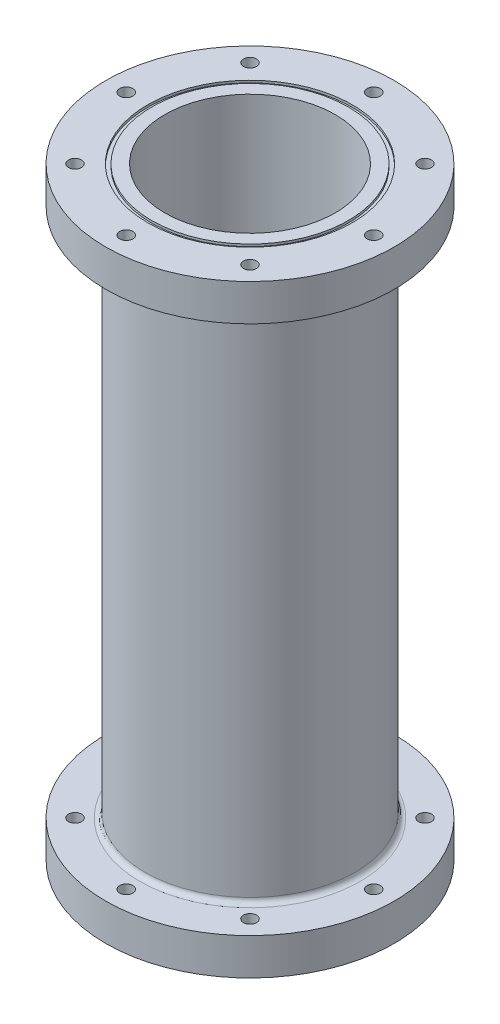
ISO-10303-21;
HEADER;
FILE_DESCRIPTION(('STEP AP214'),'2;1');
FILE_NAME('part.step','',(''),(''),'','','');
FILE_SCHEMA(('AUTOMOTIVE_DESIGN { 1 0 10303 214 1 1 1 1 }'));
ENDSEC;
DATA;
#1=APPLICATION_CONTEXT('core data for automotive mechanical design processes');
#2=APPLICATION_PROTOCOL_DEFINITION('international standard','automotive_design',2000,#1);
#3=PRODUCT_CONTEXT('',#1,'mechanical');
#4=PRODUCT('Part','Part','',(#3));
#5=PRODUCT_RELATED_PRODUCT_CATEGORY('part','',(#4));
#6=PRODUCT_DEFINITION_FORMATION('','',#4);
#7=PRODUCT_DEFINITION_CONTEXT('part definition',#1,'design');
#8=PRODUCT_DEFINITION('design','',#6,#7);
#9=PRODUCT_DEFINITION_SHAPE('','',#8);
#10=(LENGTH_UNIT() NAMED_UNIT(*) SI_UNIT(.MILLI.,.METRE.));
#11=(NAMED_UNIT(*) PLANE_ANGLE_UNIT() SI_UNIT($,.RADIAN.));
#12=(NAMED_UNIT(*) SI_UNIT($,.STERADIAN.) SOLID_ANGLE_UNIT());
#13=UNCERTAINTY_MEASURE_WITH_UNIT(LENGTH_MEASURE(1.E-05),#10,'distance_accuracy_value','');
#14=(GEOMETRIC_REPRESENTATION_CONTEXT(3) GLOBAL_UNCERTAINTY_ASSIGNED_CONTEXT((#13)) GLOBAL_UNIT_ASSIGNED_CONTEXT((#10,
#11,#12)) REPRESENTATION_CONTEXT('',''));
#15=CARTESIAN_POINT('',(0.,0.,0.));
#16=DIRECTION('',(0.,0.,1.));
#17=DIRECTION('',(1.,0.,0.));
#18=AXIS2_PLACEMENT_3D('',#15,#16,#17);
#19=CARTESIAN_POINT('',(0.,292.1,0.));
#20=DIRECTION('',(0.,1.,0.));
#21=DIRECTION('',(0.,0.,1.));
#22=AXIS2_PLACEMENT_3D('',#19,#20,#21);
#23=PLANE('',#22);
#24=CARTESIAN_POINT('',(0.,292.1,0.));
#25=DIRECTION('',(0.,1.,0.));
#26=DIRECTION('',(0.,0.,1.));
#27=AXIS2_PLACEMENT_3D('',#24,#25,#26);
#28=CIRCLE('',#27,41.275);
#29=CARTESIAN_POINT('',(0.,292.1,41.275));
#30=VERTEX_POINT('',#29);
#31=EDGE_CURVE('E52',#30,#30,#28,.T.);
#32=ORIENTED_EDGE('',*,*,#31,.F.);
#33=EDGE_LOOP('',(#32));
#34=FACE_BOUND('',#33,.T.);
#35=CARTESIAN_POINT('',(0.,292.1,0.));
#36=DIRECTION('',(0.,1.,0.));
#37=DIRECTION('',(0.,0.,1.));
#38=AXIS2_PLACEMENT_3D('',#35,#36,#37);
#39=CIRCLE('',#38,47.625);
#40=CARTESIAN_POINT('',(0.,292.1,47.625));
#41=VERTEX_POINT('',#40);
#42=EDGE_CURVE('E129',#41,#41,#39,.T.);
#43=ORIENTED_EDGE('',*,*,#42,.T.);
#44=EDGE_LOOP('',(#43));
#45=FACE_BOUND('',#44,.T.);
#46=ADVANCED_FACE('F32',(#34,#45),#23,.T.);
#47=CARTESIAN_POINT('',(0.,0.,0.));
#48=DIRECTION('',(0.,1.,0.));
#49=DIRECTION('',(0.,0.,1.));
#50=AXIS2_PLACEMENT_3D('',#47,#48,#49);
#51=PLANE('',#50);
#52=CARTESIAN_POINT('',(0.,0.,0.));
#53=DIRECTION('',(0.,1.,0.));
#54=DIRECTION('',(0.,0.,1.));
#55=AXIS2_PLACEMENT_3D('',#52,#53,#54);
#56=CIRCLE('',#55,41.275);
#57=CARTESIAN_POINT('',(0.,0.,41.275));
#58=VERTEX_POINT('',#57);
#59=EDGE_CURVE('E93',#58,#58,#56,.T.);
#60=ORIENTED_EDGE('',*,*,#59,.T.);
#61=EDGE_LOOP('',(#60));
#62=FACE_BOUND('',#61,.T.);
#63=CARTESIAN_POINT('',(0.,0.,0.));
#64=DIRECTION('',(0.,-1.,0.));
#65=DIRECTION('',(0.,0.,-1.));
#66=AXIS2_PLACEMENT_3D('',#63,#64,#65);
#67=CIRCLE('',#66,47.625);
#68=CARTESIAN_POINT('',(0.,0.,-47.625));
#69=VERTEX_POINT('',#68);
#70=EDGE_CURVE('E117',#69,#69,#67,.T.);
#71=ORIENTED_EDGE('',*,*,#70,.T.);
#72=EDGE_LOOP('',(#71));
#73=FACE_BOUND('',#72,.T.);
#74=ADVANCED_FACE('F242',(#62,#73),#51,.F.);
#75=CARTESIAN_POINT('',(0.,292.1,0.));
#76=DIRECTION('',(0.,-1.,0.));
#77=DIRECTION('',(0.,0.,-1.));
#78=AXIS2_PLACEMENT_3D('',#75,#76,#77);
#79=CYLINDRICAL_SURFACE('',#78,50.8);
#80=CARTESIAN_POINT('',(0.,20.32,0.));
#81=DIRECTION('',(0.,-1.,0.));
#82=DIRECTION('',(0.,0.,-1.));
#83=AXIS2_PLACEMENT_3D('',#80,#81,#82);
#84=CIRCLE('',#83,50.8);
#85=CARTESIAN_POINT('',(0.,20.32,-50.8));
#86=VERTEX_POINT('',#85);
#87=EDGE_CURVE('E39',#86,#86,#84,.F.);
#88=ORIENTED_EDGE('',*,*,#87,.T.);
#89=EDGE_LOOP('',(#88));
#90=FACE_BOUND('',#89,.T.);
#91=CARTESIAN_POINT('',(0.,271.78,0.));
#92=DIRECTION('',(0.,1.,0.));
#93=DIRECTION('',(0.,0.,1.));
#94=AXIS2_PLACEMENT_3D('',#91,#92,#93);
#95=CIRCLE('',#94,50.8);
#96=CARTESIAN_POINT('',(0.,271.78,50.8));
#97=VERTEX_POINT('',#96);
#98=EDGE_CURVE('E43',#97,#97,#95,.F.);
#99=ORIENTED_EDGE('',*,*,#98,.T.);
#100=EDGE_LOOP('',(#99));
#101=FACE_BOUND('',#100,.T.);
#102=ADVANCED_FACE('F233',(#90,#101),#79,.T.);
#103=CARTESIAN_POINT('',(-59.9186,292.1,0.));
#104=DIRECTION('',(0.,-1.,0.));
#105=DIRECTION('',(0.,0.,-1.));
#106=AXIS2_PLACEMENT_3D('',#103,#104,#105);
#107=CIRCLE('',#106,3.175);
#108=CARTESIAN_POINT('',(-59.9186,292.1,-3.175));
#109=VERTEX_POINT('',#108);
#110=EDGE_CURVE('E92',#109,#109,#107,.T.);
#111=ORIENTED_EDGE('',*,*,#110,.T.);
#112=EDGE_LOOP('',(#111));
#113=FACE_BOUND('',#112,.T.);
#114=CARTESIAN_POINT('',(-42.3688483792043,292.1,42.3688483792043));
#115=DIRECTION('',(0.,-1.,0.));
#116=DIRECTION('',(0.,0.,-1.));
#117=AXIS2_PLACEMENT_3D('',#114,#115,#116);
#118=CIRCLE('',#117,3.175);
#119=CARTESIAN_POINT('',(-42.3688483792043,292.1,39.1938483792043));
#120=VERTEX_POINT('',#119);
#121=EDGE_CURVE('E185',#120,#120,#118,.T.);
#122=ORIENTED_EDGE('',*,*,#121,.T.);
#123=EDGE_LOOP('',(#122));
#124=FACE_BOUND('',#123,.T.);
#125=CARTESIAN_POINT('',(0.,292.1,59.9186));
#126=DIRECTION('',(0.,-1.,0.));
#127=DIRECTION('',(0.,0.,-1.));
#128=AXIS2_PLACEMENT_3D('',#125,#126,#127);
#129=CIRCLE('',#128,3.175);
#130=CARTESIAN_POINT('',(0.,292.1,56.7436));
#131=VERTEX_POINT('',#130);
#132=EDGE_CURVE('E182',#131,#131,#129,.T.);
#133=ORIENTED_EDGE('',*,*,#132,.T.);
#134=EDGE_LOOP('',(#133));
#135=FACE_BOUND('',#134,.T.);
#136=CARTESIAN_POINT('',(42.3688483792043,292.1,42.3688483792043));
#137=DIRECTION('',(0.,-1.,0.));
#138=DIRECTION('',(0.,0.,-1.));
#139=AXIS2_PLACEMENT_3D('',#136,#137,#138);
#140=CIRCLE('',#139,3.175);
#141=CARTESIAN_POINT('',(42.3688483792043,292.1,39.1938483792043));
#142=VERTEX_POINT('',#141);
#143=EDGE_CURVE('E179',#142,#142,#140,.T.);
#144=ORIENTED_EDGE('',*,*,#143,.T.);
#145=EDGE_LOOP('',(#144));
#146=FACE_BOUND('',#145,.T.);
#147=CARTESIAN_POINT('',(59.9186,292.1,0.));
#148=DIRECTION('',(0.,-1.,0.));
#149=DIRECTION('',(0.,0.,-1.));
#150=AXIS2_PLACEMENT_3D('',#147,#148,#149);
#151=CIRCLE('',#150,3.17500000000001);
#152=CARTESIAN_POINT('',(59.9186,292.1,-3.175));
#153=VERTEX_POINT('',#152);
#154=EDGE_CURVE('E176',#153,#153,#151,.T.);
#155=ORIENTED_EDGE('',*,*,#154,.T.);
#156=EDGE_LOOP('',(#155));
#157=FACE_BOUND('',#156,.T.);
#158=CARTESIAN_POINT('',(42.3688483792043,292.1,-42.3688483792043));
#159=DIRECTION('',(0.,-1.,0.));
#160=DIRECTION('',(0.,0.,-1.));
#161=AXIS2_PLACEMENT_3D('',#158,#159,#160);
#162=CIRCLE('',#161,3.17500000000001);
#163=CARTESIAN_POINT('',(42.3688483792043,292.1,-45.5438483792043));
#164=VERTEX_POINT('',#163);
#165=EDGE_CURVE('E173',#164,#164,#162,.T.);
#166=ORIENTED_EDGE('',*,*,#165,.T.);
#167=EDGE_LOOP('',(#166));
#168=FACE_BOUND('',#167,.T.);
#169=CARTESIAN_POINT('',(0.,292.1,-59.9186));
#170=DIRECTION('',(0.,-1.,0.));
#171=DIRECTION('',(0.,0.,-1.));
#172=AXIS2_PLACEMENT_3D('',#169,#170,#171);
#173=CIRCLE('',#172,3.175);
#174=CARTESIAN_POINT('',(0.,292.1,-63.0936));
#175=VERTEX_POINT('',#174);
#176=EDGE_CURVE('E170',#175,#175,#173,.T.);
#177=ORIENTED_EDGE('',*,*,#176,.T.);
#178=EDGE_LOOP('',(#177));
#179=FACE_BOUND('',#178,.T.);
#180=CARTESIAN_POINT('',(-42.3688483792043,292.1,-42.3688483792043));
#181=DIRECTION('',(0.,-1.,0.));
#182=DIRECTION('',(0.,0.,-1.));
#183=AXIS2_PLACEMENT_3D('',#180,#181,#182);
#184=CIRCLE('',#183,3.17500000000001);
#185=CARTESIAN_POINT('',(-42.3688483792043,292.1,-45.5438483792043));
#186=VERTEX_POINT('',#185);
#187=EDGE_CURVE('E167',#186,#186,#184,.T.);
#188=ORIENTED_EDGE('',*,*,#187,.T.);
#189=EDGE_LOOP('',(#188));
#190=FACE_BOUND('',#189,.T.);
#191=CARTESIAN_POINT('',(0.,292.1,0.));
#192=DIRECTION('',(0.,1.,0.));
#193=DIRECTION('',(0.,0.,1.));
#194=AXIS2_PLACEMENT_3D('',#191,#192,#193);
#195=CIRCLE('',#194,49.53);
#196=CARTESIAN_POINT('',(0.,292.1,49.53));
#197=VERTEX_POINT('',#196);
#198=EDGE_CURVE('E123',#197,#197,#195,.T.);
#199=ORIENTED_EDGE('',*,*,#198,.F.);
#200=EDGE_LOOP('',(#199));
#201=FACE_BOUND('',#200,.T.);
#202=CARTESIAN_POINT('',(0.,292.1,0.));
#203=DIRECTION('',(0.,1.,0.));
#204=DIRECTION('',(0.,0.,1.));
#205=AXIS2_PLACEMENT_3D('',#202,#203,#204);
#206=CIRCLE('',#205,69.85);
#207=CARTESIAN_POINT('',(0.,292.1,69.85));
#208=VERTEX_POINT('',#207);
#209=EDGE_CURVE('E105',#208,#208,#206,.T.);
#210=ORIENTED_EDGE('',*,*,#209,.T.);
#211=EDGE_LOOP('',(#210));
#212=FACE_BOUND('',#211,.T.);
#213=ADVANCED_FACE('F191',(#113,#124,#135,#146,#157,#168,#179,#190,#201,#212),#23,.T.);
#214=CARTESIAN_POINT('',(-59.9186,0.,0.));
#215=DIRECTION('',(0.,1.,0.));
#216=DIRECTION('',(0.,0.,1.));
#217=AXIS2_PLACEMENT_3D('',#214,#215,#216);
#218=CIRCLE('',#217,3.175);
#219=CARTESIAN_POINT('',(-59.9186,0.,3.175));
#220=VERTEX_POINT('',#219);
#221=EDGE_CURVE('E132',#220,#220,#218,.T.);
#222=ORIENTED_EDGE('',*,*,#221,.T.);
#223=EDGE_LOOP('',(#222));
#224=FACE_BOUND('',#223,.T.);
#225=CARTESIAN_POINT('',(-42.3688483792043,0.,42.3688483792043));
#226=DIRECTION('',(0.,1.,0.));
#227=DIRECTION('',(0.,0.,1.));
#228=AXIS2_PLACEMENT_3D('',#225,#226,#227);
#229=CIRCLE('',#228,3.175);
#230=CARTESIAN_POINT('',(-42.3688483792043,0.,45.5438483792043));
#231=VERTEX_POINT('',#230);
#232=EDGE_CURVE('E57',#231,#231,#229,.T.);
#233=ORIENTED_EDGE('',*,*,#232,.T.);
#234=EDGE_LOOP('',(#233));
#235=FACE_BOUND('',#234,.T.);
#236=CARTESIAN_POINT('',(0.,0.,59.9186));
#237=DIRECTION('',(0.,1.,0.));
#238=DIRECTION('',(0.,0.,1.));
#239=AXIS2_PLACEMENT_3D('',#236,#237,#238);
#240=CIRCLE('',#239,3.175);
#241=CARTESIAN_POINT('',(0.,0.,63.0936));
#242=VERTEX_POINT('',#241);
#243=EDGE_CURVE('E62',#242,#242,#240,.T.);
#244=ORIENTED_EDGE('',*,*,#243,.T.);
#245=EDGE_LOOP('',(#244));
#246=FACE_BOUND('',#245,.T.);
#247=CARTESIAN_POINT('',(42.3688483792043,0.,42.3688483792043));
#248=DIRECTION('',(0.,1.,0.));
#249=DIRECTION('',(0.,0.,1.));
#250=AXIS2_PLACEMENT_3D('',#247,#248,#249);
#251=CIRCLE('',#250,3.175);
#252=CARTESIAN_POINT('',(42.3688483792043,0.,45.5438483792043));
#253=VERTEX_POINT('',#252);
#254=EDGE_CURVE('E67',#253,#253,#251,.T.);
#255=ORIENTED_EDGE('',*,*,#254,.T.);
#256=EDGE_LOOP('',(#255));
#257=FACE_BOUND('',#256,.T.);
#258=CARTESIAN_POINT('',(59.9186,0.,0.));
#259=DIRECTION('',(0.,1.,0.));
#260=DIRECTION('',(0.,0.,1.));
#261=AXIS2_PLACEMENT_3D('',#258,#259,#260);
#262=CIRCLE('',#261,3.17500000000001);
#263=CARTESIAN_POINT('',(59.9186,0.,3.17500000000001));
#264=VERTEX_POINT('',#263);
#265=EDGE_CURVE('E72',#264,#264,#262,.T.);
#266=ORIENTED_EDGE('',*,*,#265,.T.);
#267=EDGE_LOOP('',(#266));
#268=FACE_BOUND('',#267,.T.);
#269=CARTESIAN_POINT('',(42.3688483792043,0.,-42.3688483792043));
#270=DIRECTION('',(0.,1.,0.));
#271=DIRECTION('',(0.,0.,1.));
#272=AXIS2_PLACEMENT_3D('',#269,#270,#271);
#273=CIRCLE('',#272,3.17500000000001);
#274=CARTESIAN_POINT('',(42.3688483792043,0.,-39.1938483792043));
#275=VERTEX_POINT('',#274);
#276=EDGE_CURVE('E77',#275,#275,#273,.T.);
#277=ORIENTED_EDGE('',*,*,#276,.T.);
#278=EDGE_LOOP('',(#277));
#279=FACE_BOUND('',#278,.T.);
#280=CARTESIAN_POINT('',(0.,0.,-59.9186));
#281=DIRECTION('',(0.,1.,0.));
#282=DIRECTION('',(0.,0.,1.));
#283=AXIS2_PLACEMENT_3D('',#280,#281,#282);
#284=CIRCLE('',#283,3.175);
#285=CARTESIAN_POINT('',(0.,0.,-56.7436));
#286=VERTEX_POINT('',#285);
#287=EDGE_CURVE('E82',#286,#286,#284,.T.);
#288=ORIENTED_EDGE('',*,*,#287,.T.);
#289=EDGE_LOOP('',(#288));
#290=FACE_BOUND('',#289,.T.);
#291=CARTESIAN_POINT('',(-42.3688483792043,0.,-42.3688483792043));
#292=DIRECTION('',(0.,1.,0.));
#293=DIRECTION('',(0.,0.,1.));
#294=AXIS2_PLACEMENT_3D('',#291,#292,#293);
#295=CIRCLE('',#294,3.17500000000001);
#296=CARTESIAN_POINT('',(-42.3688483792043,0.,-39.1938483792043));
#297=VERTEX_POINT('',#296);
#298=EDGE_CURVE('E87',#297,#297,#295,.T.);
#299=ORIENTED_EDGE('',*,*,#298,.T.);
#300=EDGE_LOOP('',(#299));
#301=FACE_BOUND('',#300,.T.);
#302=CARTESIAN_POINT('',(0.,0.,0.));
#303=DIRECTION('',(0.,-1.,0.));
#304=DIRECTION('',(0.,0.,-1.));
#305=AXIS2_PLACEMENT_3D('',#302,#303,#304);
#306=CIRCLE('',#305,49.53);
#307=CARTESIAN_POINT('',(0.,0.,-49.53));
#308=VERTEX_POINT('',#307);
#309=EDGE_CURVE('E111',#308,#308,#306,.T.);
#310=ORIENTED_EDGE('',*,*,#309,.F.);
#311=EDGE_LOOP('',(#310));
#312=FACE_BOUND('',#311,.T.);
#313=CARTESIAN_POINT('',(0.,0.,0.));
#314=DIRECTION('',(0.,-1.,0.));
#315=DIRECTION('',(0.,0.,-1.));
#316=AXIS2_PLACEMENT_3D('',#313,#314,#315);
#317=CIRCLE('',#316,69.85);
#318=CARTESIAN_POINT('',(0.,0.,-69.85));
#319=VERTEX_POINT('',#318);
#320=EDGE_CURVE('E99',#319,#319,#317,.T.);
#321=ORIENTED_EDGE('',*,*,#320,.T.);
#322=EDGE_LOOP('',(#321));
#323=FACE_BOUND('',#322,.T.);
#324=ADVANCED_FACE('F232',(#224,#235,#246,#257,#268,#279,#290,#301,#312,#323),#51,.F.);
#325=CARTESIAN_POINT('',(0.,292.1,0.));
#326=DIRECTION('',(0.,-1.,0.));
#327=DIRECTION('',(0.,0.,-1.));
#328=AXIS2_PLACEMENT_3D('',#325,#326,#327);
#329=CYLINDRICAL_SURFACE('',#328,41.275);
#330=ORIENTED_EDGE('',*,*,#31,.T.);
#331=EDGE_LOOP('',(#330));
#332=FACE_BOUND('',#331,.T.);
#333=ORIENTED_EDGE('',*,*,#59,.F.);
#334=EDGE_LOOP('',(#333));
#335=FACE_BOUND('',#334,.T.);
#336=ADVANCED_FACE('F239',(#332,#335),#329,.F.);
#337=CARTESIAN_POINT('',(0.,17.78,0.));
#338=DIRECTION('',(0.,-1.,0.));
#339=DIRECTION('',(0.,0.,-1.));
#340=AXIS2_PLACEMENT_3D('',#337,#338,#339);
#341=PLANE('',#340);
#342=CARTESIAN_POINT('',(0.,17.78,0.));
#343=DIRECTION('',(0.,-1.,0.));
#344=DIRECTION('',(0.,0.,-1.));
#345=AXIS2_PLACEMENT_3D('',#342,#343,#344);
#346=CIRCLE('',#345,53.34);
#347=CARTESIAN_POINT('',(0.,17.78,-53.34));
#348=VERTEX_POINT('',#347);
#349=EDGE_CURVE('E47',#348,#348,#346,.T.);
#350=ORIENTED_EDGE('',*,*,#349,.T.);
#351=EDGE_LOOP('',(#350));
#352=FACE_BOUND('',#351,.T.);
#353=CARTESIAN_POINT('',(-59.9186,17.78,0.));
#354=DIRECTION('',(0.,-1.,0.));
#355=DIRECTION('',(0.,0.,-1.));
#356=AXIS2_PLACEMENT_3D('',#353,#354,#355);
#357=CIRCLE('',#356,3.175);
#358=CARTESIAN_POINT('',(-59.9186,17.78,-3.175));
#359=VERTEX_POINT('',#358);
#360=EDGE_CURVE('E56',#359,#359,#357,.T.);
#361=ORIENTED_EDGE('',*,*,#360,.T.);
#362=EDGE_LOOP('',(#361));
#363=FACE_BOUND('',#362,.T.);
#364=CARTESIAN_POINT('',(-42.3688483792043,17.78,42.3688483792043));
#365=DIRECTION('',(0.,-1.,0.));
#366=DIRECTION('',(0.,0.,-1.));
#367=AXIS2_PLACEMENT_3D('',#364,#365,#366);
#368=CIRCLE('',#367,3.175);
#369=CARTESIAN_POINT('',(-42.3688483792043,17.78,39.1938483792043));
#370=VERTEX_POINT('',#369);
#371=EDGE_CURVE('E61',#370,#370,#368,.T.);
#372=ORIENTED_EDGE('',*,*,#371,.T.);
#373=EDGE_LOOP('',(#372));
#374=FACE_BOUND('',#373,.T.);
#375=CARTESIAN_POINT('',(0.,17.78,59.9186));
#376=DIRECTION('',(0.,-1.,0.));
#377=DIRECTION('',(0.,0.,-1.));
#378=AXIS2_PLACEMENT_3D('',#375,#376,#377);
#379=CIRCLE('',#378,3.175);
#380=CARTESIAN_POINT('',(0.,17.78,56.7436));
#381=VERTEX_POINT('',#380);
#382=EDGE_CURVE('E66',#381,#381,#379,.T.);
#383=ORIENTED_EDGE('',*,*,#382,.T.);
#384=EDGE_LOOP('',(#383));
#385=FACE_BOUND('',#384,.T.);
#386=CARTESIAN_POINT('',(42.3688483792043,17.78,42.3688483792043));
#387=DIRECTION('',(0.,-1.,0.));
#388=DIRECTION('',(0.,0.,-1.));
#389=AXIS2_PLACEMENT_3D('',#386,#387,#388);
#390=CIRCLE('',#389,3.175);
#391=CARTESIAN_POINT('',(42.3688483792043,17.78,39.1938483792043));
#392=VERTEX_POINT('',#391);
#393=EDGE_CURVE('E71',#392,#392,#390,.T.);
#394=ORIENTED_EDGE('',*,*,#393,.T.);
#395=EDGE_LOOP('',(#394));
#396=FACE_BOUND('',#395,.T.);
#397=CARTESIAN_POINT('',(59.9186,17.78,0.));
#398=DIRECTION('',(0.,-1.,0.));
#399=DIRECTION('',(0.,0.,-1.));
#400=AXIS2_PLACEMENT_3D('',#397,#398,#399);
#401=CIRCLE('',#400,3.17500000000001);
#402=CARTESIAN_POINT('',(59.9186,17.78,-3.175));
#403=VERTEX_POINT('',#402);
#404=EDGE_CURVE('E76',#403,#403,#401,.T.);
#405=ORIENTED_EDGE('',*,*,#404,.T.);
#406=EDGE_LOOP('',(#405));
#407=FACE_BOUND('',#406,.T.);
#408=CARTESIAN_POINT('',(42.3688483792043,17.78,-42.3688483792043));
#409=DIRECTION('',(0.,-1.,0.));
#410=DIRECTION('',(0.,0.,-1.));
#411=AXIS2_PLACEMENT_3D('',#408,#409,#410);
#412=CIRCLE('',#411,3.17500000000001);
#413=CARTESIAN_POINT('',(42.3688483792043,17.78,-45.5438483792043));
#414=VERTEX_POINT('',#413);
#415=EDGE_CURVE('E81',#414,#414,#412,.T.);
#416=ORIENTED_EDGE('',*,*,#415,.T.);
#417=EDGE_LOOP('',(#416));
#418=FACE_BOUND('',#417,.T.);
#419=CARTESIAN_POINT('',(0.,17.78,-59.9186));
#420=DIRECTION('',(0.,-1.,0.));
#421=DIRECTION('',(0.,0.,-1.));
#422=AXIS2_PLACEMENT_3D('',#419,#420,#421);
#423=CIRCLE('',#422,3.175);
#424=CARTESIAN_POINT('',(0.,17.78,-63.0936));
#425=VERTEX_POINT('',#424);
#426=EDGE_CURVE('E86',#425,#425,#423,.T.);
#427=ORIENTED_EDGE('',*,*,#426,.T.);
#428=EDGE_LOOP('',(#427));
#429=FACE_BOUND('',#428,.T.);
#430=CARTESIAN_POINT('',(-42.3688483792043,17.78,-42.3688483792043));
#431=DIRECTION('',(0.,-1.,0.));
#432=DIRECTION('',(0.,0.,-1.));
#433=AXIS2_PLACEMENT_3D('',#430,#431,#432);
#434=CIRCLE('',#433,3.17500000000001);
#435=CARTESIAN_POINT('',(-42.3688483792043,17.78,-45.5438483792043));
#436=VERTEX_POINT('',#435);
#437=EDGE_CURVE('E91',#436,#436,#434,.T.);
#438=ORIENTED_EDGE('',*,*,#437,.T.);
#439=EDGE_LOOP('',(#438));
#440=FACE_BOUND('',#439,.T.);
#441=CARTESIAN_POINT('',(0.,17.78,0.));
#442=DIRECTION('',(0.,-1.,0.));
#443=DIRECTION('',(0.,0.,-1.));
#444=AXIS2_PLACEMENT_3D('',#441,#442,#443);
#445=CIRCLE('',#444,69.85);
#446=CARTESIAN_POINT('',(0.,17.78,-69.85));
#447=VERTEX_POINT('',#446);
#448=EDGE_CURVE('E96',#447,#447,#445,.T.);
#449=ORIENTED_EDGE('',*,*,#448,.F.);
#450=EDGE_LOOP('',(#449));
#451=FACE_BOUND('',#450,.T.);
#452=ADVANCED_FACE('F287',(#352,#363,#374,#385,#396,#407,#418,#429,#440,#451),#341,.F.);
#453=CARTESIAN_POINT('',(0.,17.78,0.));
#454=DIRECTION('',(0.,-1.,0.));
#455=DIRECTION('',(0.,0.,-1.));
#456=AXIS2_PLACEMENT_3D('',#453,#454,#455);
#457=CYLINDRICAL_SURFACE('',#456,69.85);
#458=ORIENTED_EDGE('',*,*,#448,.T.);
#459=EDGE_LOOP('',(#458));
#460=FACE_BOUND('',#459,.T.);
#461=ORIENTED_EDGE('',*,*,#320,.F.);
#462=EDGE_LOOP('',(#461));
#463=FACE_BOUND('',#462,.T.);
#464=ADVANCED_FACE('F207',(#460,#463),#457,.T.);
#465=CARTESIAN_POINT('',(0.,274.32,0.));
#466=DIRECTION('',(0.,1.,0.));
#467=DIRECTION('',(0.,0.,1.));
#468=AXIS2_PLACEMENT_3D('',#465,#466,#467);
#469=PLANE('',#468);
#470=CARTESIAN_POINT('',(0.,274.32,0.));
#471=DIRECTION('',(0.,1.,0.));
#472=DIRECTION('',(0.,0.,1.));
#473=AXIS2_PLACEMENT_3D('',#470,#471,#472);
#474=CIRCLE('',#473,53.34);
#475=CARTESIAN_POINT('',(0.,274.32,53.34));
#476=VERTEX_POINT('',#475);
#477=EDGE_CURVE('E10',#476,#476,#474,.T.);
#478=ORIENTED_EDGE('',*,*,#477,.T.);
#479=EDGE_LOOP('',(#478));
#480=FACE_BOUND('',#479,.T.);
#481=CARTESIAN_POINT('',(-59.9186,274.32,0.));
#482=DIRECTION('',(0.,1.,0.));
#483=DIRECTION('',(0.,0.,1.));
#484=AXIS2_PLACEMENT_3D('',#481,#482,#483);
#485=CIRCLE('',#484,3.175);
#486=CARTESIAN_POINT('',(-59.9186,274.32,3.175));
#487=VERTEX_POINT('',#486);
#488=EDGE_CURVE('E53',#487,#487,#485,.T.);
#489=ORIENTED_EDGE('',*,*,#488,.T.);
#490=EDGE_LOOP('',(#489));
#491=FACE_BOUND('',#490,.T.);
#492=CARTESIAN_POINT('',(-42.3688483792043,274.32,42.3688483792043));
#493=DIRECTION('',(0.,1.,0.));
#494=DIRECTION('',(0.,0.,1.));
#495=AXIS2_PLACEMENT_3D('',#492,#493,#494);
#496=CIRCLE('',#495,3.175);
#497=CARTESIAN_POINT('',(-42.3688483792043,274.32,45.5438483792043));
#498=VERTEX_POINT('',#497);
#499=EDGE_CURVE('E58',#498,#498,#496,.T.);
#500=ORIENTED_EDGE('',*,*,#499,.T.);
#501=EDGE_LOOP('',(#500));
#502=FACE_BOUND('',#501,.T.);
#503=CARTESIAN_POINT('',(0.,274.32,59.9186));
#504=DIRECTION('',(0.,1.,0.));
#505=DIRECTION('',(0.,0.,1.));
#506=AXIS2_PLACEMENT_3D('',#503,#504,#505);
#507=CIRCLE('',#506,3.175);
#508=CARTESIAN_POINT('',(0.,274.32,63.0936));
#509=VERTEX_POINT('',#508);
#510=EDGE_CURVE('E63',#509,#509,#507,.T.);
#511=ORIENTED_EDGE('',*,*,#510,.T.);
#512=EDGE_LOOP('',(#511));
#513=FACE_BOUND('',#512,.T.);
#514=CARTESIAN_POINT('',(42.3688483792043,274.32,42.3688483792043));
#515=DIRECTION('',(0.,1.,0.));
#516=DIRECTION('',(0.,0.,1.));
#517=AXIS2_PLACEMENT_3D('',#514,#515,#516);
#518=CIRCLE('',#517,3.175);
#519=CARTESIAN_POINT('',(42.3688483792043,274.32,45.5438483792043));
#520=VERTEX_POINT('',#519);
#521=EDGE_CURVE('E68',#520,#520,#518,.T.);
#522=ORIENTED_EDGE('',*,*,#521,.T.);
#523=EDGE_LOOP('',(#522));
#524=FACE_BOUND('',#523,.T.);
#525=CARTESIAN_POINT('',(59.9186,274.32,0.));
#526=DIRECTION('',(0.,1.,0.));
#527=DIRECTION('',(0.,0.,1.));
#528=AXIS2_PLACEMENT_3D('',#525,#526,#527);
#529=CIRCLE('',#528,3.17500000000001);
#530=CARTESIAN_POINT('',(59.9186,274.32,3.17500000000001));
#531=VERTEX_POINT('',#530);
#532=EDGE_CURVE('E73',#531,#531,#529,.T.);
#533=ORIENTED_EDGE('',*,*,#532,.T.);
#534=EDGE_LOOP('',(#533));
#535=FACE_BOUND('',#534,.T.);
#536=CARTESIAN_POINT('',(42.3688483792043,274.32,-42.3688483792043));
#537=DIRECTION('',(0.,1.,0.));
#538=DIRECTION('',(0.,0.,1.));
#539=AXIS2_PLACEMENT_3D('',#536,#537,#538);
#540=CIRCLE('',#539,3.17500000000001);
#541=CARTESIAN_POINT('',(42.3688483792043,274.32,-39.1938483792043));
#542=VERTEX_POINT('',#541);
#543=EDGE_CURVE('E78',#542,#542,#540,.T.);
#544=ORIENTED_EDGE('',*,*,#543,.T.);
#545=EDGE_LOOP('',(#544));
#546=FACE_BOUND('',#545,.T.);
#547=CARTESIAN_POINT('',(0.,274.32,-59.9186));
#548=DIRECTION('',(0.,1.,0.));
#549=DIRECTION('',(0.,0.,1.));
#550=AXIS2_PLACEMENT_3D('',#547,#548,#549);
#551=CIRCLE('',#550,3.175);
#552=CARTESIAN_POINT('',(0.,274.32,-56.7436));
#553=VERTEX_POINT('',#552);
#554=EDGE_CURVE('E83',#553,#553,#551,.T.);
#555=ORIENTED_EDGE('',*,*,#554,.T.);
#556=EDGE_LOOP('',(#555));
#557=FACE_BOUND('',#556,.T.);
#558=CARTESIAN_POINT('',(-42.3688483792043,274.32,-42.3688483792043));
#559=DIRECTION('',(0.,1.,0.));
#560=DIRECTION('',(0.,0.,1.));
#561=AXIS2_PLACEMENT_3D('',#558,#559,#560);
#562=CIRCLE('',#561,3.17500000000001);
#563=CARTESIAN_POINT('',(-42.3688483792043,274.32,-39.1938483792043));
#564=VERTEX_POINT('',#563);
#565=EDGE_CURVE('E88',#564,#564,#562,.T.);
#566=ORIENTED_EDGE('',*,*,#565,.T.);
#567=EDGE_LOOP('',(#566));
#568=FACE_BOUND('',#567,.T.);
#569=CARTESIAN_POINT('',(0.,274.32,0.));
#570=DIRECTION('',(0.,1.,0.));
#571=DIRECTION('',(0.,0.,1.));
#572=AXIS2_PLACEMENT_3D('',#569,#570,#571);
#573=CIRCLE('',#572,69.85);
#574=CARTESIAN_POINT('',(0.,274.32,69.85));
#575=VERTEX_POINT('',#574);
#576=EDGE_CURVE('E102',#575,#575,#573,.T.);
#577=ORIENTED_EDGE('',*,*,#576,.F.);
#578=EDGE_LOOP('',(#577));
#579=FACE_BOUND('',#578,.T.);
#580=ADVANCED_FACE('F203',(#480,#491,#502,#513,#524,#535,#546,#557,#568,#579),#469,.F.);
#581=CARTESIAN_POINT('',(0.,274.32,0.));
#582=DIRECTION('',(0.,1.,0.));
#583=DIRECTION('',(0.,0.,1.));
#584=AXIS2_PLACEMENT_3D('',#581,#582,#583);
#585=CYLINDRICAL_SURFACE('',#584,69.85);
#586=ORIENTED_EDGE('',*,*,#576,.T.);
#587=EDGE_LOOP('',(#586));
#588=FACE_BOUND('',#587,.T.);
#589=ORIENTED_EDGE('',*,*,#209,.F.);
#590=EDGE_LOOP('',(#589));
#591=FACE_BOUND('',#590,.T.);
#592=ADVANCED_FACE('F206',(#588,#591),#585,.T.);
#593=CARTESIAN_POINT('',(0.,1.1176,0.));
#594=DIRECTION('',(0.,-1.,0.));
#595=DIRECTION('',(0.,0.,-1.));
#596=AXIS2_PLACEMENT_3D('',#593,#594,#595);
#597=CYLINDRICAL_SURFACE('',#596,49.53);
#598=CARTESIAN_POINT('',(0.,1.1176,0.));
#599=DIRECTION('',(0.,-1.,0.));
#600=DIRECTION('',(0.,0.,-1.));
#601=AXIS2_PLACEMENT_3D('',#598,#599,#600);
#602=CIRCLE('',#601,49.53);
#603=CARTESIAN_POINT('',(0.,1.1176,-49.53));
#604=VERTEX_POINT('',#603);
#605=EDGE_CURVE('E108',#604,#604,#602,.T.);
#606=ORIENTED_EDGE('',*,*,#605,.F.);
#607=EDGE_LOOP('',(#606));
#608=FACE_BOUND('',#607,.T.);
#609=ORIENTED_EDGE('',*,*,#309,.T.);
#610=EDGE_LOOP('',(#609));
#611=FACE_BOUND('',#610,.T.);
#612=ADVANCED_FACE('F227',(#608,#611),#597,.F.);
#613=CARTESIAN_POINT('',(0.,1.1176,0.));
#614=DIRECTION('',(0.,-1.,0.));
#615=DIRECTION('',(0.,0.,-1.));
#616=AXIS2_PLACEMENT_3D('',#613,#614,#615);
#617=PLANE('',#616);
#618=CARTESIAN_POINT('',(0.,1.1176,0.));
#619=DIRECTION('',(0.,-1.,0.));
#620=DIRECTION('',(0.,0.,-1.));
#621=AXIS2_PLACEMENT_3D('',#618,#619,#620);
#622=CIRCLE('',#621,47.625);
#623=CARTESIAN_POINT('',(0.,1.1176,-47.625));
#624=VERTEX_POINT('',#623);
#625=EDGE_CURVE('E114',#624,#624,#622,.T.);
#626=ORIENTED_EDGE('',*,*,#625,.F.);
#627=EDGE_LOOP('',(#626));
#628=FACE_BOUND('',#627,.T.);
#629=ORIENTED_EDGE('',*,*,#605,.T.);
#630=EDGE_LOOP('',(#629));
#631=FACE_BOUND('',#630,.T.);
#632=ADVANCED_FACE('F279',(#628,#631),#617,.T.);
#633=CARTESIAN_POINT('',(0.,1.1176,0.));
#634=DIRECTION('',(0.,-1.,0.));
#635=DIRECTION('',(0.,0.,-1.));
#636=AXIS2_PLACEMENT_3D('',#633,#634,#635);
#637=CYLINDRICAL_SURFACE('',#636,47.625);
#638=ORIENTED_EDGE('',*,*,#625,.T.);
#639=EDGE_LOOP('',(#638));
#640=FACE_BOUND('',#639,.T.);
#641=ORIENTED_EDGE('',*,*,#70,.F.);
#642=EDGE_LOOP('',(#641));
#643=FACE_BOUND('',#642,.T.);
#644=ADVANCED_FACE('F275',(#640,#643),#637,.T.);
#645=CARTESIAN_POINT('',(0.,290.9824,0.));
#646=DIRECTION('',(0.,1.,0.));
#647=DIRECTION('',(0.,0.,1.));
#648=AXIS2_PLACEMENT_3D('',#645,#646,#647);
#649=CYLINDRICAL_SURFACE('',#648,49.53);
#650=CARTESIAN_POINT('',(0.,290.9824,0.));
#651=DIRECTION('',(0.,1.,0.));
#652=DIRECTION('',(0.,0.,1.));
#653=AXIS2_PLACEMENT_3D('',#650,#651,#652);
#654=CIRCLE('',#653,49.53);
#655=CARTESIAN_POINT('',(0.,290.9824,49.53));
#656=VERTEX_POINT('',#655);
#657=EDGE_CURVE('E120',#656,#656,#654,.T.);
#658=ORIENTED_EDGE('',*,*,#657,.F.);
#659=EDGE_LOOP('',(#658));
#660=FACE_BOUND('',#659,.T.);
#661=ORIENTED_EDGE('',*,*,#198,.T.);
#662=EDGE_LOOP('',(#661));
#663=FACE_BOUND('',#662,.T.);
#664=ADVANCED_FACE('F268',(#660,#663),#649,.F.);
#665=CARTESIAN_POINT('',(0.,290.9824,0.));
#666=DIRECTION('',(0.,1.,0.));
#667=DIRECTION('',(0.,0.,1.));
#668=AXIS2_PLACEMENT_3D('',#665,#666,#667);
#669=PLANE('',#668);
#670=CARTESIAN_POINT('',(0.,290.9824,0.));
#671=DIRECTION('',(0.,1.,0.));
#672=DIRECTION('',(0.,0.,1.));
#673=AXIS2_PLACEMENT_3D('',#670,#671,#672);
#674=CIRCLE('',#673,47.625);
#675=CARTESIAN_POINT('',(0.,290.9824,47.625));
#676=VERTEX_POINT('',#675);
#677=EDGE_CURVE('E126',#676,#676,#674,.T.);
#678=ORIENTED_EDGE('',*,*,#677,.F.);
#679=EDGE_LOOP('',(#678));
#680=FACE_BOUND('',#679,.T.);
#681=ORIENTED_EDGE('',*,*,#657,.T.);
#682=EDGE_LOOP('',(#681));
#683=FACE_BOUND('',#682,.T.);
#684=ADVANCED_FACE('F258',(#680,#683),#669,.T.);
#685=CARTESIAN_POINT('',(0.,290.9824,0.));
#686=DIRECTION('',(0.,1.,0.));
#687=DIRECTION('',(0.,0.,1.));
#688=AXIS2_PLACEMENT_3D('',#685,#686,#687);
#689=CYLINDRICAL_SURFACE('',#688,47.625);
#690=ORIENTED_EDGE('',*,*,#677,.T.);
#691=EDGE_LOOP('',(#690));
#692=FACE_BOUND('',#691,.T.);
#693=ORIENTED_EDGE('',*,*,#42,.F.);
#694=EDGE_LOOP('',(#693));
#695=FACE_BOUND('',#694,.T.);
#696=ADVANCED_FACE('F255',(#692,#695),#689,.T.);
#697=CARTESIAN_POINT('',(-42.3688483792043,292.1,-42.3688483792043));
#698=DIRECTION('',(0.,-1.,0.));
#699=DIRECTION('',(0.,0.,-1.));
#700=AXIS2_PLACEMENT_3D('',#697,#698,#699);
#701=CYLINDRICAL_SURFACE('',#700,3.17500000000001);
#702=ORIENTED_EDGE('',*,*,#187,.F.);
#703=EDGE_LOOP('',(#702));
#704=FACE_BOUND('',#703,.T.);
#705=ORIENTED_EDGE('',*,*,#565,.F.);
#706=EDGE_LOOP('',(#705));
#707=FACE_BOUND('',#706,.T.);
#708=ADVANCED_FACE('F257',(#704,#707),#701,.F.);
#709=CARTESIAN_POINT('',(0.,292.1,-59.9186));
#710=DIRECTION('',(0.,-1.,0.));
#711=DIRECTION('',(0.,0.,-1.));
#712=AXIS2_PLACEMENT_3D('',#709,#710,#711);
#713=CYLINDRICAL_SURFACE('',#712,3.175);
#714=ORIENTED_EDGE('',*,*,#176,.F.);
#715=EDGE_LOOP('',(#714));
#716=FACE_BOUND('',#715,.T.);
#717=ORIENTED_EDGE('',*,*,#554,.F.);
#718=EDGE_LOOP('',(#717));
#719=FACE_BOUND('',#718,.T.);
#720=ADVANCED_FACE('F265',(#716,#719),#713,.F.);
#721=CARTESIAN_POINT('',(42.3688483792043,292.1,-42.3688483792043));
#722=DIRECTION('',(0.,-1.,0.));
#723=DIRECTION('',(0.,0.,-1.));
#724=AXIS2_PLACEMENT_3D('',#721,#722,#723);
#725=CYLINDRICAL_SURFACE('',#724,3.17500000000001);
#726=ORIENTED_EDGE('',*,*,#165,.F.);
#727=EDGE_LOOP('',(#726));
#728=FACE_BOUND('',#727,.T.);
#729=ORIENTED_EDGE('',*,*,#543,.F.);
#730=EDGE_LOOP('',(#729));
#731=FACE_BOUND('',#730,.T.);
#732=ADVANCED_FACE('F373',(#728,#731),#725,.F.);
#733=CARTESIAN_POINT('',(59.9186,292.1,0.));
#734=DIRECTION('',(0.,-1.,0.));
#735=DIRECTION('',(0.,0.,-1.));
#736=AXIS2_PLACEMENT_3D('',#733,#734,#735);
#737=CYLINDRICAL_SURFACE('',#736,3.17500000000001);
#738=ORIENTED_EDGE('',*,*,#154,.F.);
#739=EDGE_LOOP('',(#738));
#740=FACE_BOUND('',#739,.T.);
#741=ORIENTED_EDGE('',*,*,#532,.F.);
#742=EDGE_LOOP('',(#741));
#743=FACE_BOUND('',#742,.T.);
#744=ADVANCED_FACE('F383',(#740,#743),#737,.F.);
#745=CARTESIAN_POINT('',(42.3688483792043,292.1,42.3688483792043));
#746=DIRECTION('',(0.,-1.,0.));
#747=DIRECTION('',(0.,0.,-1.));
#748=AXIS2_PLACEMENT_3D('',#745,#746,#747);
#749=CYLINDRICAL_SURFACE('',#748,3.175);
#750=ORIENTED_EDGE('',*,*,#143,.F.);
#751=EDGE_LOOP('',(#750));
#752=FACE_BOUND('',#751,.T.);
#753=ORIENTED_EDGE('',*,*,#521,.F.);
#754=EDGE_LOOP('',(#753));
#755=FACE_BOUND('',#754,.T.);
#756=ADVANCED_FACE('F394',(#752,#755),#749,.F.);
#757=CARTESIAN_POINT('',(0.,292.1,59.9186));
#758=DIRECTION('',(0.,-1.,0.));
#759=DIRECTION('',(0.,0.,-1.));
#760=AXIS2_PLACEMENT_3D('',#757,#758,#759);
#761=CYLINDRICAL_SURFACE('',#760,3.175);
#762=ORIENTED_EDGE('',*,*,#132,.F.);
#763=EDGE_LOOP('',(#762));
#764=FACE_BOUND('',#763,.T.);
#765=ORIENTED_EDGE('',*,*,#510,.F.);
#766=EDGE_LOOP('',(#765));
#767=FACE_BOUND('',#766,.T.);
#768=ADVANCED_FACE('F405',(#764,#767),#761,.F.);
#769=CARTESIAN_POINT('',(-42.3688483792043,292.1,42.3688483792043));
#770=DIRECTION('',(0.,-1.,0.));
#771=DIRECTION('',(0.,0.,-1.));
#772=AXIS2_PLACEMENT_3D('',#769,#770,#771);
#773=CYLINDRICAL_SURFACE('',#772,3.175);
#774=ORIENTED_EDGE('',*,*,#121,.F.);
#775=EDGE_LOOP('',(#774));
#776=FACE_BOUND('',#775,.T.);
#777=ORIENTED_EDGE('',*,*,#499,.F.);
#778=EDGE_LOOP('',(#777));
#779=FACE_BOUND('',#778,.T.);
#780=ADVANCED_FACE('F198',(#776,#779),#773,.F.);
#781=CARTESIAN_POINT('',(-59.9186,292.1,0.));
#782=DIRECTION('',(0.,-1.,0.));
#783=DIRECTION('',(0.,0.,-1.));
#784=AXIS2_PLACEMENT_3D('',#781,#782,#783);
#785=CYLINDRICAL_SURFACE('',#784,3.175);
#786=ORIENTED_EDGE('',*,*,#110,.F.);
#787=EDGE_LOOP('',(#786));
#788=FACE_BOUND('',#787,.T.);
#789=ORIENTED_EDGE('',*,*,#488,.F.);
#790=EDGE_LOOP('',(#789));
#791=FACE_BOUND('',#790,.T.);
#792=ADVANCED_FACE('F194',(#788,#791),#785,.F.);
#793=ORIENTED_EDGE('',*,*,#437,.F.);
#794=EDGE_LOOP('',(#793));
#795=FACE_BOUND('',#794,.T.);
#796=ORIENTED_EDGE('',*,*,#298,.F.);
#797=EDGE_LOOP('',(#796));
#798=FACE_BOUND('',#797,.T.);
#799=ADVANCED_FACE('F197',(#795,#798),#701,.F.);
#800=ORIENTED_EDGE('',*,*,#426,.F.);
#801=EDGE_LOOP('',(#800));
#802=FACE_BOUND('',#801,.T.);
#803=ORIENTED_EDGE('',*,*,#287,.F.);
#804=EDGE_LOOP('',(#803));
#805=FACE_BOUND('',#804,.T.);
#806=ADVANCED_FACE('F375',(#802,#805),#713,.F.);
#807=ORIENTED_EDGE('',*,*,#415,.F.);
#808=EDGE_LOOP('',(#807));
#809=FACE_BOUND('',#808,.T.);
#810=ORIENTED_EDGE('',*,*,#276,.F.);
#811=EDGE_LOOP('',(#810));
#812=FACE_BOUND('',#811,.T.);
#813=ADVANCED_FACE('F386',(#809,#812),#725,.F.);
#814=ORIENTED_EDGE('',*,*,#404,.F.);
#815=EDGE_LOOP('',(#814));
#816=FACE_BOUND('',#815,.T.);
#817=ORIENTED_EDGE('',*,*,#265,.F.);
#818=EDGE_LOOP('',(#817));
#819=FACE_BOUND('',#818,.T.);
#820=ADVANCED_FACE('F397',(#816,#819),#737,.F.);
#821=ORIENTED_EDGE('',*,*,#393,.F.);
#822=EDGE_LOOP('',(#821));
#823=FACE_BOUND('',#822,.T.);
#824=ORIENTED_EDGE('',*,*,#254,.F.);
#825=EDGE_LOOP('',(#824));
#826=FACE_BOUND('',#825,.T.);
#827=ADVANCED_FACE('F408',(#823,#826),#749,.F.);
#828=ORIENTED_EDGE('',*,*,#382,.F.);
#829=EDGE_LOOP('',(#828));
#830=FACE_BOUND('',#829,.T.);
#831=ORIENTED_EDGE('',*,*,#243,.F.);
#832=EDGE_LOOP('',(#831));
#833=FACE_BOUND('',#832,.T.);
#834=ADVANCED_FACE('F418',(#830,#833),#761,.F.);
#835=ORIENTED_EDGE('',*,*,#371,.F.);
#836=EDGE_LOOP('',(#835));
#837=FACE_BOUND('',#836,.T.);
#838=ORIENTED_EDGE('',*,*,#232,.F.);
#839=EDGE_LOOP('',(#838));
#840=FACE_BOUND('',#839,.T.);
#841=ADVANCED_FACE('F428',(#837,#840),#773,.F.);
#842=ORIENTED_EDGE('',*,*,#360,.F.);
#843=EDGE_LOOP('',(#842));
#844=FACE_BOUND('',#843,.T.);
#845=ORIENTED_EDGE('',*,*,#221,.F.);
#846=EDGE_LOOP('',(#845));
#847=FACE_BOUND('',#846,.T.);
#848=ADVANCED_FACE('F200',(#844,#847),#785,.F.);
#849=CARTESIAN_POINT('',(0.,20.32,0.));
#850=DIRECTION('',(0.,-1.,0.));
#851=DIRECTION('',(0.,0.,-1.));
#852=AXIS2_PLACEMENT_3D('',#849,#850,#851);
#853=TOROIDAL_SURFACE('',#852,53.34,2.54);
#854=ORIENTED_EDGE('',*,*,#87,.F.);
#855=EDGE_LOOP('',(#854));
#856=FACE_BOUND('',#855,.T.);
#857=ORIENTED_EDGE('',*,*,#349,.F.);
#858=EDGE_LOOP('',(#857));
#859=FACE_BOUND('',#858,.T.);
#860=ADVANCED_FACE('F497',(#856,#859),#853,.F.);
#861=CARTESIAN_POINT('',(0.,271.78,0.));
#862=DIRECTION('',(0.,1.,0.));
#863=DIRECTION('',(0.,0.,1.));
#864=AXIS2_PLACEMENT_3D('',#861,#862,#863);
#865=TOROIDAL_SURFACE('',#864,53.34,2.54);
#866=ORIENTED_EDGE('',*,*,#98,.F.);
#867=EDGE_LOOP('',(#866));
#868=FACE_BOUND('',#867,.T.);
#869=ORIENTED_EDGE('',*,*,#477,.F.);
#870=EDGE_LOOP('',(#869));
#871=FACE_BOUND('',#870,.T.);
#872=ADVANCED_FACE('F34',(#868,#871),#865,.F.);
#873=CLOSED_SHELL('',(#46,#74,#102,#213,#324,#336,#452,#464,#580,#592,#612,#632,#644,#664,#684,
#696,#708,#720,#732,#744,#756,#768,#780,#792,#799,#806,#813,#820,#827,#834,#841,#848,#860,#872));
#874=MANIFOLD_SOLID_BREP('B2',#873);
#875=ADVANCED_BREP_SHAPE_REPRESENTATION('',(#18,#874),#14);
#876=SHAPE_DEFINITION_REPRESENTATION(#9,#875);
ENDSEC;
END-ISO-10303-21;
